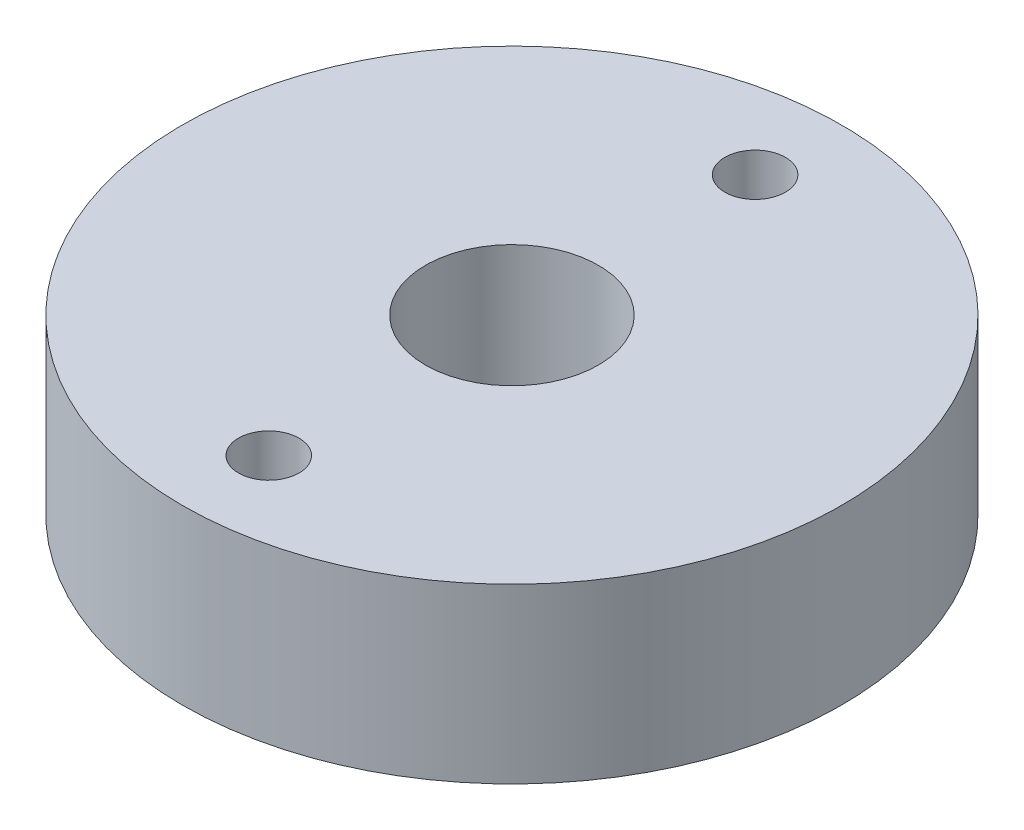
ISO-10303-21;
HEADER;
FILE_DESCRIPTION(('STEP AP214'),'2;1');
FILE_NAME('part.step','',(''),(''),'','','');
FILE_SCHEMA(('AUTOMOTIVE_DESIGN { 1 0 10303 214 1 1 1 1 }'));
ENDSEC;
DATA;
#1=APPLICATION_CONTEXT('core data for automotive mechanical design processes');
#2=APPLICATION_PROTOCOL_DEFINITION('international standard','automotive_design',2000,#1);
#3=PRODUCT_CONTEXT('',#1,'mechanical');
#4=PRODUCT('Part','Part','',(#3));
#5=PRODUCT_RELATED_PRODUCT_CATEGORY('part','',(#4));
#6=PRODUCT_DEFINITION_FORMATION('','',#4);
#7=PRODUCT_DEFINITION_CONTEXT('part definition',#1,'design');
#8=PRODUCT_DEFINITION('design','',#6,#7);
#9=PRODUCT_DEFINITION_SHAPE('','',#8);
#10=(LENGTH_UNIT() NAMED_UNIT(*) SI_UNIT(.MILLI.,.METRE.));
#11=(NAMED_UNIT(*) PLANE_ANGLE_UNIT() SI_UNIT($,.RADIAN.));
#12=(NAMED_UNIT(*) SI_UNIT($,.STERADIAN.) SOLID_ANGLE_UNIT());
#13=UNCERTAINTY_MEASURE_WITH_UNIT(LENGTH_MEASURE(1.E-05),#10,'distance_accuracy_value','');
#14=(GEOMETRIC_REPRESENTATION_CONTEXT(3) GLOBAL_UNCERTAINTY_ASSIGNED_CONTEXT((#13)) GLOBAL_UNIT_ASSIGNED_CONTEXT((#10,
#11,#12)) REPRESENTATION_CONTEXT('',''));
#15=CARTESIAN_POINT('',(0.,0.,0.));
#16=DIRECTION('',(0.,0.,1.));
#17=DIRECTION('',(1.,0.,0.));
#18=AXIS2_PLACEMENT_3D('',#15,#16,#17);
#19=CARTESIAN_POINT('',(0.,10.,0.));
#20=DIRECTION('',(0.,1.,0.));
#21=DIRECTION('',(0.,0.,1.));
#22=AXIS2_PLACEMENT_3D('',#19,#20,#21);
#23=PLANE('',#22);
#24=CARTESIAN_POINT('',(0.,10.,14.06));
#25=DIRECTION('',(0.,1.,0.));
#26=DIRECTION('',(0.,0.,1.));
#27=AXIS2_PLACEMENT_3D('',#24,#25,#26);
#28=CIRCLE('',#27,1.75);
#29=CARTESIAN_POINT('',(0.,10.,15.81));
#30=VERTEX_POINT('',#29);
#31=EDGE_CURVE('E60',#30,#30,#28,.T.);
#32=ORIENTED_EDGE('',*,*,#31,.F.);
#33=EDGE_LOOP('',(#32));
#34=FACE_BOUND('',#33,.T.);
#35=CARTESIAN_POINT('',(0.,10.,0.));
#36=DIRECTION('',(0.,1.,0.));
#37=DIRECTION('',(0.,0.,1.));
#38=AXIS2_PLACEMENT_3D('',#35,#36,#37);
#39=CIRCLE('',#38,19.055);
#40=CARTESIAN_POINT('',(0.,10.,19.055));
#41=VERTEX_POINT('',#40);
#42=EDGE_CURVE('E10',#41,#41,#39,.T.);
#43=ORIENTED_EDGE('',*,*,#42,.T.);
#44=EDGE_LOOP('',(#43));
#45=FACE_BOUND('',#44,.T.);
#46=CARTESIAN_POINT('',(0.,10.,0.));
#47=DIRECTION('',(0.,1.,0.));
#48=DIRECTION('',(0.,0.,1.));
#49=AXIS2_PLACEMENT_3D('',#46,#47,#48);
#50=CIRCLE('',#49,5.);
#51=CARTESIAN_POINT('',(0.,10.,5.));
#52=VERTEX_POINT('',#51);
#53=EDGE_CURVE('E54',#52,#52,#50,.T.);
#54=ORIENTED_EDGE('',*,*,#53,.F.);
#55=EDGE_LOOP('',(#54));
#56=FACE_BOUND('',#55,.T.);
#57=CARTESIAN_POINT('',(0.,10.,-14.06));
#58=DIRECTION('',(0.,1.,0.));
#59=DIRECTION('',(0.,0.,1.));
#60=AXIS2_PLACEMENT_3D('',#57,#58,#59);
#61=CIRCLE('',#60,1.75);
#62=CARTESIAN_POINT('',(0.,10.,-12.31));
#63=VERTEX_POINT('',#62);
#64=EDGE_CURVE('E68',#63,#63,#61,.T.);
#65=ORIENTED_EDGE('',*,*,#64,.F.);
#66=EDGE_LOOP('',(#65));
#67=FACE_BOUND('',#66,.T.);
#68=ADVANCED_FACE('F41',(#34,#45,#56,#67),#23,.T.);
#69=CARTESIAN_POINT('',(0.,0.,0.));
#70=DIRECTION('',(0.,1.,0.));
#71=DIRECTION('',(0.,0.,1.));
#72=AXIS2_PLACEMENT_3D('',#69,#70,#71);
#73=PLANE('',#72);
#74=CARTESIAN_POINT('',(0.,0.,0.));
#75=DIRECTION('',(0.,1.,0.));
#76=DIRECTION('',(0.,0.,1.));
#77=AXIS2_PLACEMENT_3D('',#74,#75,#76);
#78=CIRCLE('',#77,19.055);
#79=CARTESIAN_POINT('',(0.,0.,19.055));
#80=VERTEX_POINT('',#79);
#81=EDGE_CURVE('E45',#80,#80,#78,.T.);
#82=ORIENTED_EDGE('',*,*,#81,.F.);
#83=EDGE_LOOP('',(#82));
#84=FACE_BOUND('',#83,.T.);
#85=CARTESIAN_POINT('',(0.,0.,0.));
#86=DIRECTION('',(0.,1.,0.));
#87=DIRECTION('',(0.,0.,1.));
#88=AXIS2_PLACEMENT_3D('',#85,#86,#87);
#89=CIRCLE('',#88,5.);
#90=CARTESIAN_POINT('',(0.,0.,5.));
#91=VERTEX_POINT('',#90);
#92=EDGE_CURVE('E56',#91,#91,#89,.T.);
#93=ORIENTED_EDGE('',*,*,#92,.T.);
#94=EDGE_LOOP('',(#93));
#95=FACE_BOUND('',#94,.T.);
#96=CARTESIAN_POINT('',(0.,0.,14.06));
#97=DIRECTION('',(0.,1.,0.));
#98=DIRECTION('',(0.,0.,1.));
#99=AXIS2_PLACEMENT_3D('',#96,#97,#98);
#100=CIRCLE('',#99,1.75);
#101=CARTESIAN_POINT('',(0.,0.,15.81));
#102=VERTEX_POINT('',#101);
#103=EDGE_CURVE('E64',#102,#102,#100,.T.);
#104=ORIENTED_EDGE('',*,*,#103,.T.);
#105=EDGE_LOOP('',(#104));
#106=FACE_BOUND('',#105,.T.);
#107=CARTESIAN_POINT('',(0.,0.,-14.06));
#108=DIRECTION('',(0.,1.,0.));
#109=DIRECTION('',(0.,0.,1.));
#110=AXIS2_PLACEMENT_3D('',#107,#108,#109);
#111=CIRCLE('',#110,1.75);
#112=CARTESIAN_POINT('',(0.,0.,-12.31));
#113=VERTEX_POINT('',#112);
#114=EDGE_CURVE('E72',#113,#113,#111,.T.);
#115=ORIENTED_EDGE('',*,*,#114,.T.);
#116=EDGE_LOOP('',(#115));
#117=FACE_BOUND('',#116,.T.);
#118=ADVANCED_FACE('F84',(#84,#95,#106,#117),#73,.F.);
#119=CARTESIAN_POINT('',(0.,10.,0.));
#120=DIRECTION('',(0.,-1.,0.));
#121=DIRECTION('',(0.,0.,-1.));
#122=AXIS2_PLACEMENT_3D('',#119,#120,#121);
#123=CYLINDRICAL_SURFACE('',#122,19.055);
#124=ORIENTED_EDGE('',*,*,#42,.F.);
#125=EDGE_LOOP('',(#124));
#126=FACE_BOUND('',#125,.T.);
#127=ORIENTED_EDGE('',*,*,#81,.T.);
#128=EDGE_LOOP('',(#127));
#129=FACE_BOUND('',#128,.T.);
#130=ADVANCED_FACE('F43',(#126,#129),#123,.T.);
#131=CARTESIAN_POINT('',(0.,10.,0.));
#132=DIRECTION('',(0.,-1.,0.));
#133=DIRECTION('',(0.,0.,-1.));
#134=AXIS2_PLACEMENT_3D('',#131,#132,#133);
#135=CYLINDRICAL_SURFACE('',#134,5.);
#136=ORIENTED_EDGE('',*,*,#53,.T.);
#137=EDGE_LOOP('',(#136));
#138=FACE_BOUND('',#137,.T.);
#139=ORIENTED_EDGE('',*,*,#92,.F.);
#140=EDGE_LOOP('',(#139));
#141=FACE_BOUND('',#140,.T.);
#142=ADVANCED_FACE('F93',(#138,#141),#135,.F.);
#143=CARTESIAN_POINT('',(0.,10.,14.06));
#144=DIRECTION('',(0.,-1.,0.));
#145=DIRECTION('',(0.,0.,-1.));
#146=AXIS2_PLACEMENT_3D('',#143,#144,#145);
#147=CYLINDRICAL_SURFACE('',#146,1.75);
#148=ORIENTED_EDGE('',*,*,#31,.T.);
#149=EDGE_LOOP('',(#148));
#150=FACE_BOUND('',#149,.T.);
#151=ORIENTED_EDGE('',*,*,#103,.F.);
#152=EDGE_LOOP('',(#151));
#153=FACE_BOUND('',#152,.T.);
#154=ADVANCED_FACE('F96',(#150,#153),#147,.F.);
#155=CARTESIAN_POINT('',(0.,10.,-14.06));
#156=DIRECTION('',(0.,-1.,0.));
#157=DIRECTION('',(0.,0.,-1.));
#158=AXIS2_PLACEMENT_3D('',#155,#156,#157);
#159=CYLINDRICAL_SURFACE('',#158,1.75);
#160=ORIENTED_EDGE('',*,*,#64,.T.);
#161=EDGE_LOOP('',(#160));
#162=FACE_BOUND('',#161,.T.);
#163=ORIENTED_EDGE('',*,*,#114,.F.);
#164=EDGE_LOOP('',(#163));
#165=FACE_BOUND('',#164,.T.);
#166=ADVANCED_FACE('F80',(#162,#165),#159,.F.);
#167=CLOSED_SHELL('',(#68,#118,#130,#142,#154,#166));
#168=MANIFOLD_SOLID_BREP('B2',#167);
#169=ADVANCED_BREP_SHAPE_REPRESENTATION('',(#18,#168),#14);
#170=SHAPE_DEFINITION_REPRESENTATION(#9,#169);
ENDSEC;
END-ISO-10303-21;
